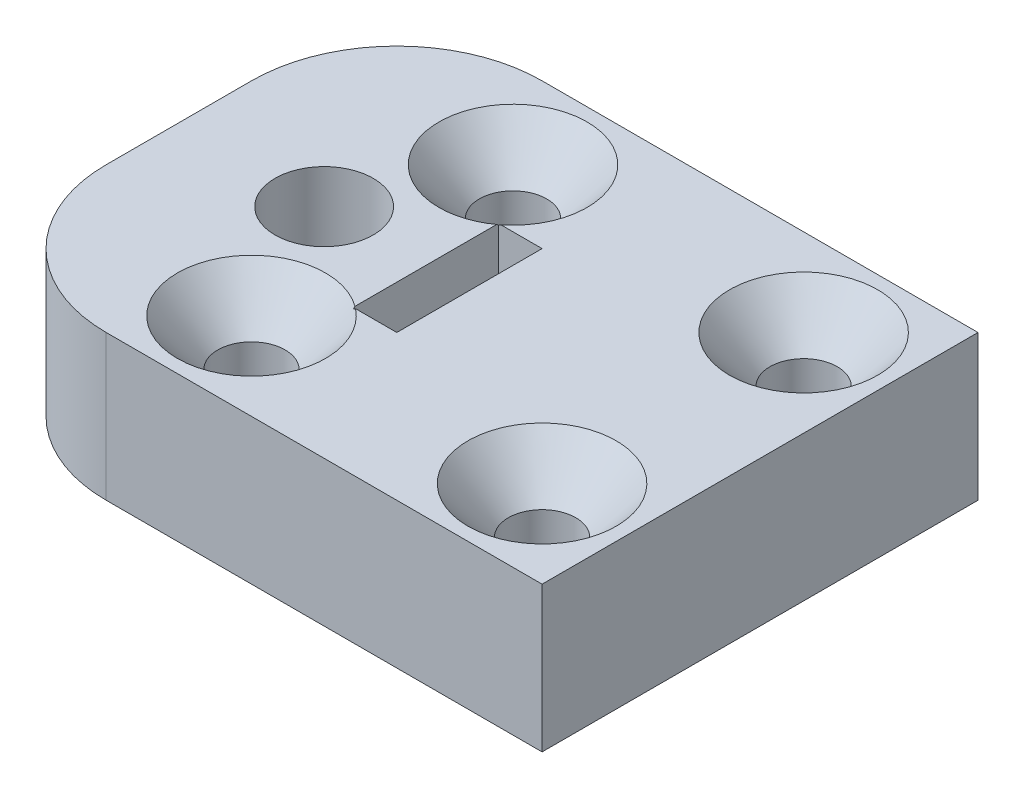
ISO-10303-21;
HEADER;
FILE_DESCRIPTION(('STEP AP214'),'2;1');
FILE_NAME('part.step','',(''),(''),'','','');
FILE_SCHEMA(('AUTOMOTIVE_DESIGN { 1 0 10303 214 1 1 1 1 }'));
ENDSEC;
DATA;
#1=APPLICATION_CONTEXT('core data for automotive mechanical design processes');
#2=APPLICATION_PROTOCOL_DEFINITION('international standard','automotive_design',2000,#1);
#3=PRODUCT_CONTEXT('',#1,'mechanical');
#4=PRODUCT('Part','Part','',(#3));
#5=PRODUCT_RELATED_PRODUCT_CATEGORY('part','',(#4));
#6=PRODUCT_DEFINITION_FORMATION('','',#4);
#7=PRODUCT_DEFINITION_CONTEXT('part definition',#1,'design');
#8=PRODUCT_DEFINITION('design','',#6,#7);
#9=PRODUCT_DEFINITION_SHAPE('','',#8);
#10=(LENGTH_UNIT() NAMED_UNIT(*) SI_UNIT(.MILLI.,.METRE.));
#11=(NAMED_UNIT(*) PLANE_ANGLE_UNIT() SI_UNIT($,.RADIAN.));
#12=(NAMED_UNIT(*) SI_UNIT($,.STERADIAN.) SOLID_ANGLE_UNIT());
#13=UNCERTAINTY_MEASURE_WITH_UNIT(LENGTH_MEASURE(1.E-05),#10,'distance_accuracy_value','');
#14=(GEOMETRIC_REPRESENTATION_CONTEXT(3) GLOBAL_UNCERTAINTY_ASSIGNED_CONTEXT((#13)) GLOBAL_UNIT_ASSIGNED_CONTEXT((#10,
#11,#12)) REPRESENTATION_CONTEXT('',''));
#15=CARTESIAN_POINT('',(0.,0.,0.));
#16=DIRECTION('',(0.,0.,1.));
#17=DIRECTION('',(1.,0.,0.));
#18=AXIS2_PLACEMENT_3D('',#15,#16,#17);
#19=CARTESIAN_POINT('',(0.,6.35,0.));
#20=DIRECTION('',(0.,1.,0.));
#21=DIRECTION('',(0.,0.,1.));
#22=AXIS2_PLACEMENT_3D('',#19,#20,#21);
#23=PLANE('',#22);
#24=CARTESIAN_POINT('',(2.54,6.35,-5.715));
#25=DIRECTION('',(0.,1.,0.));
#26=DIRECTION('',(0.,0.,1.));
#27=AXIS2_PLACEMENT_3D('',#24,#25,#26);
#28=CIRCLE('',#27,3.2385);
#29=CARTESIAN_POINT('',(4.54905008648366,6.35,-3.175));
#30=VERTEX_POINT('',#29);
#31=CARTESIAN_POINT('',(4.445,6.35,-3.09605799033274));
#32=VERTEX_POINT('',#31);
#33=EDGE_CURVE('E128',#30,#32,#28,.T.);
#34=ORIENTED_EDGE('',*,*,#33,.F.);
#35=DIRECTION('',(-1.,0.,0.));
#36=VECTOR('',#35,1.);
#37=CARTESIAN_POINT('',(6.35,6.35,-3.175));
#38=LINE('',#37,#36);
#39=CARTESIAN_POINT('',(6.35,6.35,-3.175));
#40=VERTEX_POINT('',#39);
#41=EDGE_CURVE('E142',#40,#30,#38,.T.);
#42=ORIENTED_EDGE('',*,*,#41,.F.);
#43=DIRECTION('',(0.,0.,-1.));
#44=VECTOR('',#43,1.);
#45=CARTESIAN_POINT('',(6.35,6.35,-3.175));
#46=LINE('',#45,#44);
#47=CARTESIAN_POINT('',(6.35,6.35,3.175));
#48=VERTEX_POINT('',#47);
#49=EDGE_CURVE('E151',#48,#40,#46,.T.);
#50=ORIENTED_EDGE('',*,*,#49,.F.);
#51=DIRECTION('',(1.,0.,0.));
#52=VECTOR('',#51,1.);
#53=CARTESIAN_POINT('',(6.35,6.35,3.175));
#54=LINE('',#53,#52);
#55=CARTESIAN_POINT('',(4.54905008648366,6.35,3.175));
#56=VERTEX_POINT('',#55);
#57=EDGE_CURVE('E153',#56,#48,#54,.T.);
#58=ORIENTED_EDGE('',*,*,#57,.F.);
#59=CARTESIAN_POINT('',(2.54,6.35,5.715));
#60=DIRECTION('',(0.,1.,0.));
#61=DIRECTION('',(0.,0.,1.));
#62=AXIS2_PLACEMENT_3D('',#59,#60,#61);
#63=CIRCLE('',#62,3.2385);
#64=CARTESIAN_POINT('',(4.445,6.35,3.09605799033274));
#65=VERTEX_POINT('',#64);
#66=EDGE_CURVE('E344',#65,#56,#63,.T.);
#67=ORIENTED_EDGE('',*,*,#66,.F.);
#68=DIRECTION('',(0.,0.,1.));
#69=VECTOR('',#68,1.);
#70=CARTESIAN_POINT('',(4.445,6.35,-3.175));
#71=LINE('',#70,#69);
#72=EDGE_CURVE('E144',#32,#65,#71,.T.);
#73=ORIENTED_EDGE('',*,*,#72,.F.);
#74=EDGE_LOOP('',(#34,#42,#50,#58,#67,#73));
#75=FACE_BOUND('',#74,.T.);
#76=CARTESIAN_POINT('',(15.24,6.35,5.715));
#77=DIRECTION('',(0.,1.,0.));
#78=DIRECTION('',(0.,0.,1.));
#79=AXIS2_PLACEMENT_3D('',#76,#77,#78);
#80=CIRCLE('',#79,3.2385);
#81=CARTESIAN_POINT('',(15.24,6.35,8.9535));
#82=VERTEX_POINT('',#81);
#83=EDGE_CURVE('E134',#82,#82,#80,.T.);
#84=ORIENTED_EDGE('',*,*,#83,.F.);
#85=EDGE_LOOP('',(#84));
#86=FACE_BOUND('',#85,.T.);
#87=CARTESIAN_POINT('',(15.24,6.35,-5.715));
#88=DIRECTION('',(0.,1.,0.));
#89=DIRECTION('',(0.,0.,1.));
#90=AXIS2_PLACEMENT_3D('',#87,#88,#89);
#91=CIRCLE('',#90,3.2385);
#92=CARTESIAN_POINT('',(15.24,6.35,-2.4765));
#93=VERTEX_POINT('',#92);
#94=EDGE_CURVE('E244',#93,#93,#91,.T.);
#95=ORIENTED_EDGE('',*,*,#94,.F.);
#96=EDGE_LOOP('',(#95));
#97=FACE_BOUND('',#96,.T.);
#98=CARTESIAN_POINT('',(0.,6.35,0.));
#99=DIRECTION('',(0.,1.,0.));
#100=DIRECTION('',(0.,0.,1.));
#101=AXIS2_PLACEMENT_3D('',#98,#99,#100);
#102=CIRCLE('',#101,2.1463);
#103=CARTESIAN_POINT('',(0.,6.35,2.1463));
#104=VERTEX_POINT('',#103);
#105=EDGE_CURVE('E181',#104,#104,#102,.T.);
#106=ORIENTED_EDGE('',*,*,#105,.F.);
#107=EDGE_LOOP('',(#106));
#108=FACE_BOUND('',#107,.T.);
#109=DIRECTION('',(-1.,0.,0.));
#110=VECTOR('',#109,1.);
#111=CARTESIAN_POINT('',(-6.35,6.35,-9.525));
#112=LINE('',#111,#110);
#113=CARTESIAN_POINT('',(19.05,6.35,-9.525));
#114=VERTEX_POINT('',#113);
#115=CARTESIAN_POINT('',(0.,6.35,-9.525));
#116=VERTEX_POINT('',#115);
#117=EDGE_CURVE('E194',#114,#116,#112,.T.);
#118=ORIENTED_EDGE('',*,*,#117,.T.);
#119=CARTESIAN_POINT('',(0.,6.35,-3.175));
#120=DIRECTION('',(0.,1.,0.));
#121=DIRECTION('',(0.,0.,1.));
#122=AXIS2_PLACEMENT_3D('',#119,#120,#121);
#123=CIRCLE('',#122,6.35);
#124=CARTESIAN_POINT('',(-6.35,6.35,-3.175));
#125=VERTEX_POINT('',#124);
#126=EDGE_CURVE('E41',#116,#125,#123,.T.);
#127=ORIENTED_EDGE('',*,*,#126,.T.);
#128=DIRECTION('',(0.,0.,1.));
#129=VECTOR('',#128,1.);
#130=CARTESIAN_POINT('',(-6.35,6.35,-9.525));
#131=LINE('',#130,#129);
#132=CARTESIAN_POINT('',(-6.35,6.35,3.175));
#133=VERTEX_POINT('',#132);
#134=EDGE_CURVE('E187',#125,#133,#131,.T.);
#135=ORIENTED_EDGE('',*,*,#134,.T.);
#136=CARTESIAN_POINT('',(0.,6.35,3.175));
#137=DIRECTION('',(0.,1.,0.));
#138=DIRECTION('',(0.,0.,1.));
#139=AXIS2_PLACEMENT_3D('',#136,#137,#138);
#140=CIRCLE('',#139,6.35);
#141=CARTESIAN_POINT('',(0.,6.35,9.525));
#142=VERTEX_POINT('',#141);
#143=EDGE_CURVE('E48',#133,#142,#140,.T.);
#144=ORIENTED_EDGE('',*,*,#143,.T.);
#145=DIRECTION('',(1.,0.,0.));
#146=VECTOR('',#145,1.);
#147=CARTESIAN_POINT('',(-6.35,6.35,9.525));
#148=LINE('',#147,#146);
#149=CARTESIAN_POINT('',(19.05,6.35,9.525));
#150=VERTEX_POINT('',#149);
#151=EDGE_CURVE('E189',#142,#150,#148,.T.);
#152=ORIENTED_EDGE('',*,*,#151,.T.);
#153=DIRECTION('',(0.,0.,-1.));
#154=VECTOR('',#153,1.);
#155=CARTESIAN_POINT('',(19.05,6.35,-9.525));
#156=LINE('',#155,#154);
#157=EDGE_CURVE('E192',#150,#114,#156,.T.);
#158=ORIENTED_EDGE('',*,*,#157,.T.);
#159=EDGE_LOOP('',(#118,#127,#135,#144,#152,#158));
#160=FACE_BOUND('',#159,.T.);
#161=ADVANCED_FACE('F33',(#75,#86,#97,#108,#160),#23,.T.);
#162=CARTESIAN_POINT('',(0.,0.,0.));
#163=DIRECTION('',(0.,1.,0.));
#164=DIRECTION('',(0.,0.,1.));
#165=AXIS2_PLACEMENT_3D('',#162,#163,#164);
#166=PLANE('',#165);
#167=CARTESIAN_POINT('',(2.54,0.,-5.715));
#168=DIRECTION('',(0.,1.,0.));
#169=DIRECTION('',(0.,0.,1.));
#170=AXIS2_PLACEMENT_3D('',#167,#168,#169);
#171=CIRCLE('',#170,1.4732);
#172=CARTESIAN_POINT('',(2.54,0.,-4.2418));
#173=VERTEX_POINT('',#172);
#174=EDGE_CURVE('E135',#173,#173,#171,.T.);
#175=ORIENTED_EDGE('',*,*,#174,.T.);
#176=EDGE_LOOP('',(#175));
#177=FACE_BOUND('',#176,.T.);
#178=CARTESIAN_POINT('',(15.24,0.,5.715));
#179=DIRECTION('',(0.,1.,0.));
#180=DIRECTION('',(0.,0.,1.));
#181=AXIS2_PLACEMENT_3D('',#178,#179,#180);
#182=CIRCLE('',#181,1.4732);
#183=CARTESIAN_POINT('',(15.24,0.,7.1882));
#184=VERTEX_POINT('',#183);
#185=EDGE_CURVE('E346',#184,#184,#182,.T.);
#186=ORIENTED_EDGE('',*,*,#185,.T.);
#187=EDGE_LOOP('',(#186));
#188=FACE_BOUND('',#187,.T.);
#189=CARTESIAN_POINT('',(2.54,0.,5.715));
#190=DIRECTION('',(0.,1.,0.));
#191=DIRECTION('',(0.,0.,1.));
#192=AXIS2_PLACEMENT_3D('',#189,#190,#191);
#193=CIRCLE('',#192,1.4732);
#194=CARTESIAN_POINT('',(2.54,0.,7.1882));
#195=VERTEX_POINT('',#194);
#196=EDGE_CURVE('E245',#195,#195,#193,.T.);
#197=ORIENTED_EDGE('',*,*,#196,.T.);
#198=EDGE_LOOP('',(#197));
#199=FACE_BOUND('',#198,.T.);
#200=CARTESIAN_POINT('',(15.24,0.,-5.715));
#201=DIRECTION('',(0.,1.,0.));
#202=DIRECTION('',(0.,0.,1.));
#203=AXIS2_PLACEMENT_3D('',#200,#201,#202);
#204=CIRCLE('',#203,1.4732);
#205=CARTESIAN_POINT('',(15.24,0.,-4.2418));
#206=VERTEX_POINT('',#205);
#207=EDGE_CURVE('E165',#206,#206,#204,.T.);
#208=ORIENTED_EDGE('',*,*,#207,.T.);
#209=EDGE_LOOP('',(#208));
#210=FACE_BOUND('',#209,.T.);
#211=CARTESIAN_POINT('',(0.,0.,0.));
#212=DIRECTION('',(0.,1.,0.));
#213=DIRECTION('',(0.,0.,1.));
#214=AXIS2_PLACEMENT_3D('',#211,#212,#213);
#215=CIRCLE('',#214,2.1463);
#216=CARTESIAN_POINT('',(0.,0.,2.1463));
#217=VERTEX_POINT('',#216);
#218=EDGE_CURVE('E180',#217,#217,#215,.T.);
#219=ORIENTED_EDGE('',*,*,#218,.T.);
#220=EDGE_LOOP('',(#219));
#221=FACE_BOUND('',#220,.T.);
#222=DIRECTION('',(0.,0.,1.));
#223=VECTOR('',#222,1.);
#224=CARTESIAN_POINT('',(-6.35,0.,-9.525));
#225=LINE('',#224,#223);
#226=CARTESIAN_POINT('',(-6.35,0.,-3.175));
#227=VERTEX_POINT('',#226);
#228=CARTESIAN_POINT('',(-6.35,0.,3.175));
#229=VERTEX_POINT('',#228);
#230=EDGE_CURVE('E184',#227,#229,#225,.T.);
#231=ORIENTED_EDGE('',*,*,#230,.F.);
#232=CARTESIAN_POINT('',(0.,0.,-3.175));
#233=DIRECTION('',(0.,1.,0.));
#234=DIRECTION('',(0.,0.,1.));
#235=AXIS2_PLACEMENT_3D('',#232,#233,#234);
#236=CIRCLE('',#235,6.35);
#237=CARTESIAN_POINT('',(0.,0.,-9.525));
#238=VERTEX_POINT('',#237);
#239=EDGE_CURVE('E321',#227,#238,#236,.F.);
#240=ORIENTED_EDGE('',*,*,#239,.T.);
#241=DIRECTION('',(-1.,0.,0.));
#242=VECTOR('',#241,1.);
#243=CARTESIAN_POINT('',(-6.35,0.,-9.525));
#244=LINE('',#243,#242);
#245=CARTESIAN_POINT('',(19.05,0.,-9.525));
#246=VERTEX_POINT('',#245);
#247=EDGE_CURVE('E190',#246,#238,#244,.T.);
#248=ORIENTED_EDGE('',*,*,#247,.F.);
#249=DIRECTION('',(0.,0.,-1.));
#250=VECTOR('',#249,1.);
#251=CARTESIAN_POINT('',(19.05,0.,-9.525));
#252=LINE('',#251,#250);
#253=CARTESIAN_POINT('',(19.05,0.,9.525));
#254=VERTEX_POINT('',#253);
#255=EDGE_CURVE('E201',#254,#246,#252,.T.);
#256=ORIENTED_EDGE('',*,*,#255,.F.);
#257=DIRECTION('',(1.,0.,0.));
#258=VECTOR('',#257,1.);
#259=CARTESIAN_POINT('',(-6.35,0.,9.525));
#260=LINE('',#259,#258);
#261=CARTESIAN_POINT('',(0.,0.,9.525));
#262=VERTEX_POINT('',#261);
#263=EDGE_CURVE('E199',#262,#254,#260,.T.);
#264=ORIENTED_EDGE('',*,*,#263,.F.);
#265=CARTESIAN_POINT('',(0.,0.,3.175));
#266=DIRECTION('',(0.,1.,0.));
#267=DIRECTION('',(0.,0.,1.));
#268=AXIS2_PLACEMENT_3D('',#265,#266,#267);
#269=CIRCLE('',#268,6.35);
#270=EDGE_CURVE('E323',#262,#229,#269,.F.);
#271=ORIENTED_EDGE('',*,*,#270,.T.);
#272=EDGE_LOOP('',(#231,#240,#248,#256,#264,#271));
#273=FACE_BOUND('',#272,.T.);
#274=DIRECTION('',(0.,0.,-1.));
#275=VECTOR('',#274,1.);
#276=CARTESIAN_POINT('',(6.35,0.,-3.175));
#277=LINE('',#276,#275);
#278=CARTESIAN_POINT('',(6.35,0.,3.175));
#279=VERTEX_POINT('',#278);
#280=CARTESIAN_POINT('',(6.35,0.,-3.175));
#281=VERTEX_POINT('',#280);
#282=EDGE_CURVE('E161',#279,#281,#277,.T.);
#283=ORIENTED_EDGE('',*,*,#282,.T.);
#284=DIRECTION('',(-1.,0.,0.));
#285=VECTOR('',#284,1.);
#286=CARTESIAN_POINT('',(6.35,0.,-3.175));
#287=LINE('',#286,#285);
#288=CARTESIAN_POINT('',(4.445,0.,-3.175));
#289=VERTEX_POINT('',#288);
#290=EDGE_CURVE('E164',#281,#289,#287,.T.);
#291=ORIENTED_EDGE('',*,*,#290,.T.);
#292=DIRECTION('',(0.,0.,1.));
#293=VECTOR('',#292,1.);
#294=CARTESIAN_POINT('',(4.445,0.,-3.175));
#295=LINE('',#294,#293);
#296=CARTESIAN_POINT('',(4.445,0.,3.175));
#297=VERTEX_POINT('',#296);
#298=EDGE_CURVE('E168',#289,#297,#295,.T.);
#299=ORIENTED_EDGE('',*,*,#298,.T.);
#300=DIRECTION('',(1.,0.,0.));
#301=VECTOR('',#300,1.);
#302=CARTESIAN_POINT('',(6.35,0.,3.175));
#303=LINE('',#302,#301);
#304=EDGE_CURVE('E155',#297,#279,#303,.T.);
#305=ORIENTED_EDGE('',*,*,#304,.T.);
#306=EDGE_LOOP('',(#283,#291,#299,#305));
#307=FACE_BOUND('',#306,.T.);
#308=ADVANCED_FACE('F284',(#177,#188,#199,#210,#221,#273,#307),#166,.F.);
#309=CARTESIAN_POINT('',(-6.35,6.35,-9.525));
#310=DIRECTION('',(1.,0.,0.));
#311=DIRECTION('',(0.,0.,-1.));
#312=AXIS2_PLACEMENT_3D('',#309,#310,#311);
#313=PLANE('',#312);
#314=ORIENTED_EDGE('',*,*,#134,.F.);
#315=DIRECTION('',(0.,-1.,0.));
#316=VECTOR('',#315,1.);
#317=CARTESIAN_POINT('',(-6.35,6.35,-3.175));
#318=LINE('',#317,#316);
#319=EDGE_CURVE('E316',#125,#227,#318,.T.);
#320=ORIENTED_EDGE('',*,*,#319,.T.);
#321=ORIENTED_EDGE('',*,*,#230,.T.);
#322=DIRECTION('',(0.,-1.,0.));
#323=VECTOR('',#322,1.);
#324=CARTESIAN_POINT('',(-6.35,6.35,3.175));
#325=LINE('',#324,#323);
#326=EDGE_CURVE('E325',#229,#133,#325,.F.);
#327=ORIENTED_EDGE('',*,*,#326,.T.);
#328=EDGE_LOOP('',(#314,#320,#321,#327));
#329=FACE_BOUND('',#328,.T.);
#330=ADVANCED_FACE('F289',(#329),#313,.F.);
#331=CARTESIAN_POINT('',(-6.35,6.35,9.525));
#332=DIRECTION('',(0.,0.,-1.));
#333=DIRECTION('',(-1.,0.,0.));
#334=AXIS2_PLACEMENT_3D('',#331,#332,#333);
#335=PLANE('',#334);
#336=ORIENTED_EDGE('',*,*,#151,.F.);
#337=DIRECTION('',(0.,-1.,0.));
#338=VECTOR('',#337,1.);
#339=CARTESIAN_POINT('',(0.,6.35,9.525));
#340=LINE('',#339,#338);
#341=EDGE_CURVE('E11',#142,#262,#340,.T.);
#342=ORIENTED_EDGE('',*,*,#341,.T.);
#343=ORIENTED_EDGE('',*,*,#263,.T.);
#344=DIRECTION('',(0.,-1.,0.));
#345=VECTOR('',#344,1.);
#346=CARTESIAN_POINT('',(19.05,6.35,9.525));
#347=LINE('',#346,#345);
#348=EDGE_CURVE('E206',#150,#254,#347,.T.);
#349=ORIENTED_EDGE('',*,*,#348,.F.);
#350=EDGE_LOOP('',(#336,#342,#343,#349));
#351=FACE_BOUND('',#350,.T.);
#352=ADVANCED_FACE('F300',(#351),#335,.F.);
#353=CARTESIAN_POINT('',(19.05,6.35,-9.525));
#354=DIRECTION('',(-1.,0.,0.));
#355=DIRECTION('',(0.,0.,1.));
#356=AXIS2_PLACEMENT_3D('',#353,#354,#355);
#357=PLANE('',#356);
#358=ORIENTED_EDGE('',*,*,#255,.T.);
#359=DIRECTION('',(0.,-1.,0.));
#360=VECTOR('',#359,1.);
#361=CARTESIAN_POINT('',(19.05,6.35,-9.525));
#362=LINE('',#361,#360);
#363=EDGE_CURVE('E196',#114,#246,#362,.T.);
#364=ORIENTED_EDGE('',*,*,#363,.F.);
#365=ORIENTED_EDGE('',*,*,#157,.F.);
#366=ORIENTED_EDGE('',*,*,#348,.T.);
#367=EDGE_LOOP('',(#358,#364,#365,#366));
#368=FACE_BOUND('',#367,.T.);
#369=ADVANCED_FACE('F297',(#368),#357,.F.);
#370=CARTESIAN_POINT('',(-6.35,6.35,-9.525));
#371=DIRECTION('',(0.,0.,1.));
#372=DIRECTION('',(1.,0.,0.));
#373=AXIS2_PLACEMENT_3D('',#370,#371,#372);
#374=PLANE('',#373);
#375=ORIENTED_EDGE('',*,*,#247,.T.);
#376=DIRECTION('',(0.,-1.,0.));
#377=VECTOR('',#376,1.);
#378=CARTESIAN_POINT('',(0.,6.35,-9.525));
#379=LINE('',#378,#377);
#380=EDGE_CURVE('E56',#238,#116,#379,.F.);
#381=ORIENTED_EDGE('',*,*,#380,.T.);
#382=ORIENTED_EDGE('',*,*,#117,.F.);
#383=ORIENTED_EDGE('',*,*,#363,.T.);
#384=EDGE_LOOP('',(#375,#381,#382,#383));
#385=FACE_BOUND('',#384,.T.);
#386=ADVANCED_FACE('F294',(#385),#374,.F.);
#387=CARTESIAN_POINT('',(0.,6.35,0.));
#388=DIRECTION('',(0.,-1.,0.));
#389=DIRECTION('',(0.,0.,-1.));
#390=AXIS2_PLACEMENT_3D('',#387,#388,#389);
#391=CYLINDRICAL_SURFACE('',#390,2.1463);
#392=ORIENTED_EDGE('',*,*,#105,.T.);
#393=EDGE_LOOP('',(#392));
#394=FACE_BOUND('',#393,.T.);
#395=ORIENTED_EDGE('',*,*,#218,.F.);
#396=EDGE_LOOP('',(#395));
#397=FACE_BOUND('',#396,.T.);
#398=ADVANCED_FACE('F292',(#394,#397),#391,.F.);
#399=CARTESIAN_POINT('',(6.35,6.35,-3.175));
#400=DIRECTION('',(-1.,0.,0.));
#401=DIRECTION('',(0.,0.,1.));
#402=AXIS2_PLACEMENT_3D('',#399,#400,#401);
#403=PLANE('',#402);
#404=ORIENTED_EDGE('',*,*,#282,.F.);
#405=DIRECTION('',(0.,-1.,0.));
#406=VECTOR('',#405,1.);
#407=CARTESIAN_POINT('',(6.35,6.35,3.175));
#408=LINE('',#407,#406);
#409=EDGE_CURVE('E160',#48,#279,#408,.T.);
#410=ORIENTED_EDGE('',*,*,#409,.F.);
#411=ORIENTED_EDGE('',*,*,#49,.T.);
#412=DIRECTION('',(0.,-1.,0.));
#413=VECTOR('',#412,1.);
#414=CARTESIAN_POINT('',(6.35,6.35,-3.175));
#415=LINE('',#414,#413);
#416=EDGE_CURVE('E150',#40,#281,#415,.T.);
#417=ORIENTED_EDGE('',*,*,#416,.T.);
#418=EDGE_LOOP('',(#404,#410,#411,#417));
#419=FACE_BOUND('',#418,.T.);
#420=ADVANCED_FACE('F257',(#419),#403,.T.);
#421=CARTESIAN_POINT('',(6.35,6.35,-3.175));
#422=DIRECTION('',(0.,0.,1.));
#423=DIRECTION('',(1.,0.,0.));
#424=AXIS2_PLACEMENT_3D('',#421,#422,#423);
#425=PLANE('',#424);
#426=CARTESIAN_POINT('',(3.4462198700176,5.72686766065134,-3.175));
#427=CARTESIAN_POINT('',(3.49696980765561,5.74648845653847,-3.175));
#428=CARTESIAN_POINT('',(3.54721355577106,5.76736937704712,-3.175));
#429=CARTESIAN_POINT('',(3.64669815976544,5.81133700016283,-3.175));
#430=CARTESIAN_POINT('',(3.6959395151677,5.83442256977638,-3.175));
#431=CARTESIAN_POINT('',(3.84199915842001,5.90642302995867,-3.175));
#432=CARTESIAN_POINT('',(3.93741477599154,5.95818617653089,-3.175));
#433=CARTESIAN_POINT('',(4.12431542292272,6.06703726047542,-3.175));
#434=CARTESIAN_POINT('',(4.21582103051745,6.12409046234809,-3.175));
#435=CARTESIAN_POINT('',(4.39609467248659,6.24247557231895,-3.175));
#436=CARTESIAN_POINT('',(4.48486071653618,6.30381049029903,-3.175));
#437=CARTESIAN_POINT('',(4.70503017763196,6.46204110422821,-3.175));
#438=CARTESIAN_POINT('',(4.83492534042911,6.5610263003783,-3.175));
#439=CARTESIAN_POINT('',(5.09067896524432,6.76410559741892,-3.175));
#440=CARTESIAN_POINT('',(5.21653607340928,6.86820138276126,-3.175));
#441=CARTESIAN_POINT('',(5.46528100844091,7.08016972539703,-3.175));
#442=CARTESIAN_POINT('',(5.58816500597821,7.18804675635315,-3.175));
#443=CARTESIAN_POINT('',(5.83150934893834,7.4065034494065,-3.175));
#444=CARTESIAN_POINT('',(5.95196954646919,7.5170832755128,-3.175));
#445=CARTESIAN_POINT('',(6.19344888861126,7.74260089117987,-3.175));
#446=CARTESIAN_POINT('',(6.31442793433199,7.85758150558053,-3.175));
#447=CARTESIAN_POINT('',(6.55480138968103,8.0891968305765,-3.175));
#448=CARTESIAN_POINT('',(6.67419571250619,8.20583163106191,-3.175));
#449=CARTESIAN_POINT('',(6.91123953430766,8.43994244223599,-3.175));
#450=CARTESIAN_POINT('',(7.02889401060491,8.55741342287558,-3.175));
#451=CARTESIAN_POINT('',(7.26313497337147,8.79338815439265,-3.175));
#452=CARTESIAN_POINT('',(7.37972158605063,8.911891779906,-3.175));
#453=CARTESIAN_POINT('',(7.4958910271656,9.03079877391721,-3.175));
#454=B_SPLINE_CURVE_WITH_KNOTS('',3,(#426,#427,#428,#429,#430,#431,#432,#433,#434,#435,#436,
#437,#438,#439,#440,#441,#442,#443,#444,#445,#446,#447,#448,#449,#450,#451,#452,#453),
.UNSPECIFIED.,.F.,.F.,(4,2,2,2,2,2,2,2,2,2,2,2,2,4),(0.,0.163187975963638,0.326292534558794,
0.651658770232088,0.975022354026707,1.29861558458829,1.7883506965583,2.27824832347969,
2.76874653764588,3.25927459012977,3.75996245414772,4.26067763108284,4.75944708482682,
5.25815680841769),.UNSPECIFIED.);
#455=CARTESIAN_POINT('',(4.445,6.27695160614147,-3.175));
#456=VERTEX_POINT('',#455);
#457=EDGE_CURVE('E124',#456,#30,#454,.T.);
#458=ORIENTED_EDGE('',*,*,#457,.F.);
#459=DIRECTION('',(0.,-1.,0.));
#460=VECTOR('',#459,1.);
#461=CARTESIAN_POINT('',(4.445,6.35,-3.175));
#462=LINE('',#461,#460);
#463=EDGE_CURVE('E177',#456,#289,#462,.T.);
#464=ORIENTED_EDGE('',*,*,#463,.T.);
#465=ORIENTED_EDGE('',*,*,#290,.F.);
#466=ORIENTED_EDGE('',*,*,#416,.F.);
#467=ORIENTED_EDGE('',*,*,#41,.T.);
#468=EDGE_LOOP('',(#458,#464,#465,#466,#467));
#469=FACE_BOUND('',#468,.T.);
#470=ADVANCED_FACE('F148',(#469),#425,.T.);
#471=CARTESIAN_POINT('',(4.445,6.35,-3.175));
#472=DIRECTION('',(1.,0.,0.));
#473=DIRECTION('',(0.,0.,-1.));
#474=AXIS2_PLACEMENT_3D('',#471,#472,#473);
#475=PLANE('',#474);
#476=CARTESIAN_POINT('',(4.445,9.39393760843099,-0.147329233259783));
#477=CARTESIAN_POINT('',(4.445,9.26420686195376,-0.266529766254444));
#478=CARTESIAN_POINT('',(4.445,9.1346670908311,-0.385939088557238));
#479=CARTESIAN_POINT('',(4.445,8.87607170094134,-0.625286602712824));
#480=CARTESIAN_POINT('',(4.445,8.74701609331782,-0.745224806601912));
#481=CARTESIAN_POINT('',(4.445,8.48941708577382,-0.985810732880773));
#482=CARTESIAN_POINT('',(4.445,8.36087405439258,-1.10645885020264));
#483=CARTESIAN_POINT('',(4.445,8.10453158005077,-1.34854058893118));
#484=CARTESIAN_POINT('',(4.445,7.97673212955629,-1.46997420235287));
#485=CARTESIAN_POINT('',(4.445,7.72269450424526,-1.71323677136231));
#486=CARTESIAN_POINT('',(4.445,7.59645176340916,-1.83506095314239));
#487=CARTESIAN_POINT('',(4.445,7.34518045542437,-2.07995455495262));
#488=CARTESIAN_POINT('',(4.445,7.2201518740143,-2.20302396032175));
#489=CARTESIAN_POINT('',(4.445,6.9717260298872,-2.45077136866953));
#490=CARTESIAN_POINT('',(4.445,6.84832857014788,-2.57544917370842));
#491=CARTESIAN_POINT('',(4.445,6.60375348328361,-2.82695997605585));
#492=CARTESIAN_POINT('',(4.445,6.48257572333236,-2.95379284352473));
#493=CARTESIAN_POINT('',(4.445,6.27206740242927,-3.17966670227269));
#494=CARTESIAN_POINT('',(4.445,6.18206604452416,-3.27808136067962));
#495=CARTESIAN_POINT('',(4.445,6.00457810344286,-3.47711338722715));
#496=CARTESIAN_POINT('',(4.445,5.91709072398313,-3.57773003971132));
#497=CARTESIAN_POINT('',(4.445,5.78840566417517,-3.73096085678818));
#498=CARTESIAN_POINT('',(4.445,5.74589541547651,-3.78247263983079));
#499=CARTESIAN_POINT('',(4.445,5.66194157461058,-3.886353315622));
#500=CARTESIAN_POINT('',(4.445,5.62049789747494,-3.93872213954735));
#501=CARTESIAN_POINT('',(4.445,5.53885290898295,-4.0445095802798));
#502=CARTESIAN_POINT('',(4.445,5.49865290883066,-4.09792921401146));
#503=CARTESIAN_POINT('',(4.445,5.41984160987564,-4.20594838426099));
#504=CARTESIAN_POINT('',(4.445,5.38123075429036,-4.26054824355787));
#505=CARTESIAN_POINT('',(4.445,5.34357677238979,-4.31581450324643));
#506=B_SPLINE_CURVE_WITH_KNOTS('',3,(#476,#477,#478,#479,#480,#481,#482,#483,#484,#485,#486,
#487,#488,#489,#490,#491,#492,#493,#494,#495,#496,#497,#498,#499,#500,#501,#502,#503,#504,#505),
.UNSPECIFIED.,.F.,.F.,(4,2,2,2,2,2,2,2,2,2,2,2,2,2,4),(0.,0.528535970857588,1.057084032872,
1.58596086475668,2.11483232874488,2.64113877420066,3.16743903022044,3.69367512286958,
4.21987962212625,4.61994134831619,5.01987492909692,5.22022657700484,5.42056221418871,
5.62110232551805,5.82169799426085),.UNSPECIFIED.);
#507=EDGE_CURVE('E130',#32,#456,#506,.T.);
#508=ORIENTED_EDGE('',*,*,#507,.F.);
#509=ORIENTED_EDGE('',*,*,#72,.T.);
#510=CARTESIAN_POINT('',(4.445,5.34357677238979,4.31581450324643));
#511=CARTESIAN_POINT('',(4.445,5.38123075429036,4.26054824355787));
#512=CARTESIAN_POINT('',(4.445,5.41984160987563,4.20594838426099));
#513=CARTESIAN_POINT('',(4.445,5.49865290883066,4.09792921401146));
#514=CARTESIAN_POINT('',(4.445,5.53885290898295,4.0445095802798));
#515=CARTESIAN_POINT('',(4.445,5.62049789747493,3.93872213954735));
#516=CARTESIAN_POINT('',(4.445,5.66194157461058,3.886353315622));
#517=CARTESIAN_POINT('',(4.445,5.74589541547651,3.78247263983079));
#518=CARTESIAN_POINT('',(4.445,5.78840566417516,3.73096085678818));
#519=CARTESIAN_POINT('',(4.445,5.91709072398312,3.57773003971132));
#520=CARTESIAN_POINT('',(4.445,6.00457810344286,3.47711338722715));
#521=CARTESIAN_POINT('',(4.445,6.18206604452416,3.27808136067962));
#522=CARTESIAN_POINT('',(4.445,6.27206740242926,3.17966670227269));
#523=CARTESIAN_POINT('',(4.445,6.48257572333236,2.95379284352473));
#524=CARTESIAN_POINT('',(4.445,6.60375348328361,2.82695997605585));
#525=CARTESIAN_POINT('',(4.445,6.84832857014788,2.57544917370842));
#526=CARTESIAN_POINT('',(4.445,6.9717260298872,2.45077136866953));
#527=CARTESIAN_POINT('',(4.445,7.2201518740143,2.20302396032175));
#528=CARTESIAN_POINT('',(4.445,7.34518045542437,2.07995455495263));
#529=CARTESIAN_POINT('',(4.445,7.59645176340916,1.83506095314239));
#530=CARTESIAN_POINT('',(4.445,7.72269450424526,1.71323677136231));
#531=CARTESIAN_POINT('',(4.445,7.97673212955629,1.46997420235287));
#532=CARTESIAN_POINT('',(4.445,8.10453158005076,1.34854058893118));
#533=CARTESIAN_POINT('',(4.445,8.36087405439258,1.10645885020264));
#534=CARTESIAN_POINT('',(4.445,8.48941708577382,0.985810732880773));
#535=CARTESIAN_POINT('',(4.445,8.74701609331782,0.745224806601911));
#536=CARTESIAN_POINT('',(4.445,8.87607170094134,0.625286602712824));
#537=CARTESIAN_POINT('',(4.445,9.1346670908311,0.385939088557237));
#538=CARTESIAN_POINT('',(4.445,9.26420686195376,0.266529766254442));
#539=CARTESIAN_POINT('',(4.445,9.39393760843099,0.147329233259782));
#540=B_SPLINE_CURVE_WITH_KNOTS('',3,(#510,#511,#512,#513,#514,#515,#516,#517,#518,#519,#520,
#521,#522,#523,#524,#525,#526,#527,#528,#529,#530,#531,#532,#533,#534,#535,#536,#537,#538,#539),
.UNSPECIFIED.,.F.,.F.,(4,2,2,2,2,2,2,2,2,2,2,2,2,2,4),(0.,0.200595668742799,0.401135780072138,
0.601471417256004,0.801823065163922,1.20175664594465,1.60181837213459,2.12802287139127,
2.6542589640404,3.18055922006019,3.70686566551597,4.23573712950416,4.76461396138884,
5.29316202340326,5.82169799426085),.UNSPECIFIED.);
#541=CARTESIAN_POINT('',(4.445,6.27695160614147,3.175));
#542=VERTEX_POINT('',#541);
#543=EDGE_CURVE('E237',#542,#65,#540,.T.);
#544=ORIENTED_EDGE('',*,*,#543,.F.);
#545=DIRECTION('',(0.,-1.,0.));
#546=VECTOR('',#545,1.);
#547=CARTESIAN_POINT('',(4.445,6.35,3.175));
#548=LINE('',#547,#546);
#549=EDGE_CURVE('E175',#542,#297,#548,.T.);
#550=ORIENTED_EDGE('',*,*,#549,.T.);
#551=ORIENTED_EDGE('',*,*,#298,.F.);
#552=ORIENTED_EDGE('',*,*,#463,.F.);
#553=EDGE_LOOP('',(#508,#509,#544,#550,#551,#552));
#554=FACE_BOUND('',#553,.T.);
#555=ADVANCED_FACE('F248',(#554),#475,.T.);
#556=CARTESIAN_POINT('',(6.35,6.35,3.175));
#557=DIRECTION('',(0.,0.,-1.));
#558=DIRECTION('',(-1.,0.,0.));
#559=AXIS2_PLACEMENT_3D('',#556,#557,#558);
#560=PLANE('',#559);
#561=CARTESIAN_POINT('',(7.4958910271656,9.03079877391721,3.175));
#562=CARTESIAN_POINT('',(7.37972158605063,8.911891779906,3.175));
#563=CARTESIAN_POINT('',(7.26313497337147,8.79338815439265,3.175));
#564=CARTESIAN_POINT('',(7.02889401060491,8.55741342287558,3.175));
#565=CARTESIAN_POINT('',(6.91123953430766,8.43994244223599,3.175));
#566=CARTESIAN_POINT('',(6.67419571250619,8.20583163106191,3.175));
#567=CARTESIAN_POINT('',(6.55480138968103,8.0891968305765,3.175));
#568=CARTESIAN_POINT('',(6.31442793433199,7.85758150558053,3.175));
#569=CARTESIAN_POINT('',(6.19344888861126,7.74260089117987,3.175));
#570=CARTESIAN_POINT('',(5.95196954646919,7.5170832755128,3.175));
#571=CARTESIAN_POINT('',(5.83150934893834,7.4065034494065,3.175));
#572=CARTESIAN_POINT('',(5.58816500597821,7.18804675635315,3.175));
#573=CARTESIAN_POINT('',(5.46528100844091,7.08016972539703,3.175));
#574=CARTESIAN_POINT('',(5.21653607340928,6.86820138276126,3.175));
#575=CARTESIAN_POINT('',(5.09067896524432,6.76410559741892,3.175));
#576=CARTESIAN_POINT('',(4.83492534042911,6.5610263003783,3.175));
#577=CARTESIAN_POINT('',(4.70503017763196,6.4620411042282,3.175));
#578=CARTESIAN_POINT('',(4.48486071653618,6.30381049029903,3.175));
#579=CARTESIAN_POINT('',(4.39609467248659,6.24247557231895,3.175));
#580=CARTESIAN_POINT('',(4.21582103051745,6.12409046234809,3.175));
#581=CARTESIAN_POINT('',(4.12431542292273,6.06703726047542,3.175));
#582=CARTESIAN_POINT('',(3.93741477599154,5.95818617653089,3.175));
#583=CARTESIAN_POINT('',(3.84199915842002,5.90642302995867,3.175));
#584=CARTESIAN_POINT('',(3.6959395151677,5.83442256977638,3.175));
#585=CARTESIAN_POINT('',(3.64669815976545,5.81133700016283,3.175));
#586=CARTESIAN_POINT('',(3.54721355577106,5.76736937704712,3.175));
#587=CARTESIAN_POINT('',(3.49696980765561,5.74648845653847,3.175));
#588=CARTESIAN_POINT('',(3.4462198700176,5.72686766065134,3.175));
#589=B_SPLINE_CURVE_WITH_KNOTS('',3,(#561,#562,#563,#564,#565,#566,#567,#568,#569,#570,#571,
#572,#573,#574,#575,#576,#577,#578,#579,#580,#581,#582,#583,#584,#585,#586,#587,#588),
.UNSPECIFIED.,.F.,.F.,(4,2,2,2,2,2,2,2,2,2,2,2,2,4),(0.,0.498709723590869,0.997479177334852,
1.49819435426997,1.99888221828792,2.48941027077181,2.979908484938,3.46980611185939,
3.9595412238294,4.28313445439098,4.6064980381856,4.9318642738589,5.09496883245405,
5.25815680841769),.UNSPECIFIED.);
#590=EDGE_CURVE('E209',#56,#542,#589,.T.);
#591=ORIENTED_EDGE('',*,*,#590,.F.);
#592=ORIENTED_EDGE('',*,*,#57,.T.);
#593=ORIENTED_EDGE('',*,*,#409,.T.);
#594=ORIENTED_EDGE('',*,*,#304,.F.);
#595=ORIENTED_EDGE('',*,*,#549,.F.);
#596=EDGE_LOOP('',(#591,#592,#593,#594,#595));
#597=FACE_BOUND('',#596,.T.);
#598=ADVANCED_FACE('F222',(#597),#560,.T.);
#599=CARTESIAN_POINT('',(15.24,6.35,-5.715));
#600=DIRECTION('',(0.,1.,0.));
#601=DIRECTION('',(0.,0.,1.));
#602=AXIS2_PLACEMENT_3D('',#599,#600,#601);
#603=CYLINDRICAL_SURFACE('',#602,1.4732);
#604=ORIENTED_EDGE('',*,*,#207,.F.);
#605=EDGE_LOOP('',(#604));
#606=FACE_BOUND('',#605,.T.);
#607=CARTESIAN_POINT('',(15.24,4.31925465073275,-5.715));
#608=DIRECTION('',(0.,1.,0.));
#609=DIRECTION('',(0.,0.,1.));
#610=AXIS2_PLACEMENT_3D('',#607,#608,#609);
#611=CIRCLE('',#610,1.4732);
#612=CARTESIAN_POINT('',(15.24,4.31925465073275,-4.2418));
#613=VERTEX_POINT('',#612);
#614=EDGE_CURVE('E505',#613,#613,#611,.T.);
#615=ORIENTED_EDGE('',*,*,#614,.T.);
#616=EDGE_LOOP('',(#615));
#617=FACE_BOUND('',#616,.T.);
#618=ADVANCED_FACE('F385',(#606,#617),#603,.F.);
#619=CARTESIAN_POINT('',(15.24,6.35,-5.715));
#620=DIRECTION('',(0.,1.,0.));
#621=DIRECTION('',(0.,0.,1.));
#622=AXIS2_PLACEMENT_3D('',#619,#620,#621);
#623=CONICAL_SURFACE('',#622,3.2385,0.715584993317675);
#624=ORIENTED_EDGE('',*,*,#614,.F.);
#625=EDGE_LOOP('',(#624));
#626=FACE_BOUND('',#625,.T.);
#627=ORIENTED_EDGE('',*,*,#94,.T.);
#628=EDGE_LOOP('',(#627));
#629=FACE_BOUND('',#628,.T.);
#630=ADVANCED_FACE('F391',(#626,#629),#623,.F.);
#631=CARTESIAN_POINT('',(2.54,6.35,5.715));
#632=DIRECTION('',(0.,1.,0.));
#633=DIRECTION('',(0.,0.,1.));
#634=AXIS2_PLACEMENT_3D('',#631,#632,#633);
#635=CYLINDRICAL_SURFACE('',#634,1.4732);
#636=ORIENTED_EDGE('',*,*,#196,.F.);
#637=EDGE_LOOP('',(#636));
#638=FACE_BOUND('',#637,.T.);
#639=CARTESIAN_POINT('',(2.54,4.31925465073275,5.715));
#640=DIRECTION('',(0.,1.,0.));
#641=DIRECTION('',(0.,0.,1.));
#642=AXIS2_PLACEMENT_3D('',#639,#640,#641);
#643=CIRCLE('',#642,1.4732);
#644=CARTESIAN_POINT('',(2.54,4.31925465073275,7.1882));
#645=VERTEX_POINT('',#644);
#646=EDGE_CURVE('E345',#645,#645,#643,.T.);
#647=ORIENTED_EDGE('',*,*,#646,.T.);
#648=EDGE_LOOP('',(#647));
#649=FACE_BOUND('',#648,.T.);
#650=ADVANCED_FACE('F231',(#638,#649),#635,.F.);
#651=CARTESIAN_POINT('',(2.54,6.35,5.715));
#652=DIRECTION('',(0.,1.,0.));
#653=DIRECTION('',(0.,0.,1.));
#654=AXIS2_PLACEMENT_3D('',#651,#652,#653);
#655=CONICAL_SURFACE('',#654,3.2385,0.715584993317675);
#656=ORIENTED_EDGE('',*,*,#543,.T.);
#657=ORIENTED_EDGE('',*,*,#66,.T.);
#658=ORIENTED_EDGE('',*,*,#590,.T.);
#659=EDGE_LOOP('',(#656,#657,#658));
#660=FACE_BOUND('',#659,.T.);
#661=ORIENTED_EDGE('',*,*,#646,.F.);
#662=EDGE_LOOP('',(#661));
#663=FACE_BOUND('',#662,.T.);
#664=ADVANCED_FACE('F225',(#660,#663),#655,.F.);
#665=CARTESIAN_POINT('',(15.24,6.35,5.715));
#666=DIRECTION('',(0.,1.,0.));
#667=DIRECTION('',(0.,0.,1.));
#668=AXIS2_PLACEMENT_3D('',#665,#666,#667);
#669=CYLINDRICAL_SURFACE('',#668,1.4732);
#670=ORIENTED_EDGE('',*,*,#185,.F.);
#671=EDGE_LOOP('',(#670));
#672=FACE_BOUND('',#671,.T.);
#673=CARTESIAN_POINT('',(15.24,4.31925465073275,5.715));
#674=DIRECTION('',(0.,1.,0.));
#675=DIRECTION('',(0.,0.,1.));
#676=AXIS2_PLACEMENT_3D('',#673,#674,#675);
#677=CIRCLE('',#676,1.4732);
#678=CARTESIAN_POINT('',(15.24,4.31925465073275,7.1882));
#679=VERTEX_POINT('',#678);
#680=EDGE_CURVE('E350',#679,#679,#677,.T.);
#681=ORIENTED_EDGE('',*,*,#680,.T.);
#682=EDGE_LOOP('',(#681));
#683=FACE_BOUND('',#682,.T.);
#684=ADVANCED_FACE('F230',(#672,#683),#669,.F.);
#685=CARTESIAN_POINT('',(15.24,6.35,5.715));
#686=DIRECTION('',(0.,1.,0.));
#687=DIRECTION('',(0.,0.,1.));
#688=AXIS2_PLACEMENT_3D('',#685,#686,#687);
#689=CONICAL_SURFACE('',#688,3.2385,0.715584993317675);
#690=ORIENTED_EDGE('',*,*,#680,.F.);
#691=EDGE_LOOP('',(#690));
#692=FACE_BOUND('',#691,.T.);
#693=ORIENTED_EDGE('',*,*,#83,.T.);
#694=EDGE_LOOP('',(#693));
#695=FACE_BOUND('',#694,.T.);
#696=ADVANCED_FACE('F273',(#692,#695),#689,.F.);
#697=CARTESIAN_POINT('',(2.54,6.35,-5.715));
#698=DIRECTION('',(0.,1.,0.));
#699=DIRECTION('',(0.,0.,1.));
#700=AXIS2_PLACEMENT_3D('',#697,#698,#699);
#701=CYLINDRICAL_SURFACE('',#700,1.4732);
#702=ORIENTED_EDGE('',*,*,#174,.F.);
#703=EDGE_LOOP('',(#702));
#704=FACE_BOUND('',#703,.T.);
#705=CARTESIAN_POINT('',(2.54,4.31925465073275,-5.715));
#706=DIRECTION('',(0.,1.,0.));
#707=DIRECTION('',(0.,0.,1.));
#708=AXIS2_PLACEMENT_3D('',#705,#706,#707);
#709=CIRCLE('',#708,1.4732);
#710=CARTESIAN_POINT('',(2.54,4.31925465073275,-4.2418));
#711=VERTEX_POINT('',#710);
#712=EDGE_CURVE('E145',#711,#711,#709,.T.);
#713=ORIENTED_EDGE('',*,*,#712,.T.);
#714=EDGE_LOOP('',(#713));
#715=FACE_BOUND('',#714,.T.);
#716=ADVANCED_FACE('F270',(#704,#715),#701,.F.);
#717=CARTESIAN_POINT('',(2.54,6.35,-5.715));
#718=DIRECTION('',(0.,1.,0.));
#719=DIRECTION('',(0.,0.,1.));
#720=AXIS2_PLACEMENT_3D('',#717,#718,#719);
#721=CONICAL_SURFACE('',#720,3.2385,0.715584993317675);
#722=ORIENTED_EDGE('',*,*,#457,.T.);
#723=ORIENTED_EDGE('',*,*,#33,.T.);
#724=ORIENTED_EDGE('',*,*,#507,.T.);
#725=EDGE_LOOP('',(#722,#723,#724));
#726=FACE_BOUND('',#725,.T.);
#727=ORIENTED_EDGE('',*,*,#712,.F.);
#728=EDGE_LOOP('',(#727));
#729=FACE_BOUND('',#728,.T.);
#730=ADVANCED_FACE('F126',(#726,#729),#721,.F.);
#731=CARTESIAN_POINT('',(0.,6.35,-3.175));
#732=DIRECTION('',(0.,-1.,0.));
#733=DIRECTION('',(0.,0.,-1.));
#734=AXIS2_PLACEMENT_3D('',#731,#732,#733);
#735=CYLINDRICAL_SURFACE('',#734,6.35);
#736=ORIENTED_EDGE('',*,*,#126,.F.);
#737=ORIENTED_EDGE('',*,*,#380,.F.);
#738=ORIENTED_EDGE('',*,*,#239,.F.);
#739=ORIENTED_EDGE('',*,*,#319,.F.);
#740=EDGE_LOOP('',(#736,#737,#738,#739));
#741=FACE_BOUND('',#740,.T.);
#742=ADVANCED_FACE('F269',(#741),#735,.T.);
#743=CARTESIAN_POINT('',(0.,6.35,3.175));
#744=DIRECTION('',(0.,-1.,0.));
#745=DIRECTION('',(0.,0.,-1.));
#746=AXIS2_PLACEMENT_3D('',#743,#744,#745);
#747=CYLINDRICAL_SURFACE('',#746,6.35);
#748=ORIENTED_EDGE('',*,*,#143,.F.);
#749=ORIENTED_EDGE('',*,*,#326,.F.);
#750=ORIENTED_EDGE('',*,*,#270,.F.);
#751=ORIENTED_EDGE('',*,*,#341,.F.);
#752=EDGE_LOOP('',(#748,#749,#750,#751));
#753=FACE_BOUND('',#752,.T.);
#754=ADVANCED_FACE('F35',(#753),#747,.T.);
#755=CLOSED_SHELL('',(#161,#308,#330,#352,#369,#386,#398,#420,#470,#555,#598,#618,#630,#650,
#664,#684,#696,#716,#730,#742,#754));
#756=MANIFOLD_SOLID_BREP('B2',#755);
#757=ADVANCED_BREP_SHAPE_REPRESENTATION('',(#18,#756),#14);
#758=SHAPE_DEFINITION_REPRESENTATION(#9,#757);
ENDSEC;
END-ISO-10303-21;
